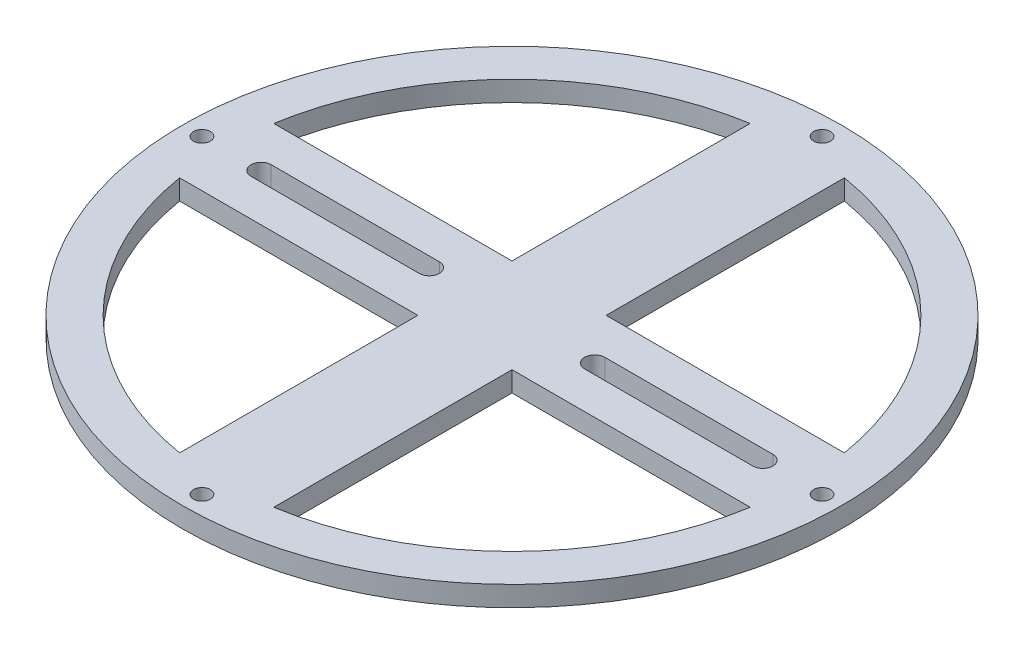
ISO-10303-21;
HEADER;
FILE_DESCRIPTION(('STEP AP214'),'2;1');
FILE_NAME('part.step','',(''),(''),'','','');
FILE_SCHEMA(('AUTOMOTIVE_DESIGN { 1 0 10303 214 1 1 1 1 }'));
ENDSEC;
DATA;
#1=APPLICATION_CONTEXT('core data for automotive mechanical design processes');
#2=APPLICATION_PROTOCOL_DEFINITION('international standard','automotive_design',2000,#1);
#3=PRODUCT_CONTEXT('',#1,'mechanical');
#4=PRODUCT('Part','Part','',(#3));
#5=PRODUCT_RELATED_PRODUCT_CATEGORY('part','',(#4));
#6=PRODUCT_DEFINITION_FORMATION('','',#4);
#7=PRODUCT_DEFINITION_CONTEXT('part definition',#1,'design');
#8=PRODUCT_DEFINITION('design','',#6,#7);
#9=PRODUCT_DEFINITION_SHAPE('','',#8);
#10=(LENGTH_UNIT() NAMED_UNIT(*) SI_UNIT(.MILLI.,.METRE.));
#11=(NAMED_UNIT(*) PLANE_ANGLE_UNIT() SI_UNIT($,.RADIAN.));
#12=(NAMED_UNIT(*) SI_UNIT($,.STERADIAN.) SOLID_ANGLE_UNIT());
#13=UNCERTAINTY_MEASURE_WITH_UNIT(LENGTH_MEASURE(1.E-05),#10,'distance_accuracy_value','');
#14=(GEOMETRIC_REPRESENTATION_CONTEXT(3) GLOBAL_UNCERTAINTY_ASSIGNED_CONTEXT((#13)) GLOBAL_UNIT_ASSIGNED_CONTEXT((#10,
#11,#12)) REPRESENTATION_CONTEXT('',''));
#15=CARTESIAN_POINT('',(0.,0.,0.));
#16=DIRECTION('',(0.,0.,1.));
#17=DIRECTION('',(1.,0.,0.));
#18=AXIS2_PLACEMENT_3D('',#15,#16,#17);
#19=CARTESIAN_POINT('',(0.,3.,0.));
#20=DIRECTION('',(0.,-1.,0.));
#21=DIRECTION('',(0.,0.,-1.));
#22=AXIS2_PLACEMENT_3D('',#19,#20,#21);
#23=CYLINDRICAL_SURFACE('',#22,49.);
#24=CARTESIAN_POINT('',(0.,3.,0.));
#25=DIRECTION('',(0.,1.,0.));
#26=DIRECTION('',(0.,0.,1.));
#27=AXIS2_PLACEMENT_3D('',#24,#25,#26);
#28=CIRCLE('',#27,49.);
#29=CARTESIAN_POINT('',(0.,3.,49.));
#30=VERTEX_POINT('',#29);
#31=EDGE_CURVE('E11',#30,#30,#28,.T.);
#32=ORIENTED_EDGE('',*,*,#31,.F.);
#33=EDGE_LOOP('',(#32));
#34=FACE_BOUND('',#33,.T.);
#35=CARTESIAN_POINT('',(0.,0.,0.));
#36=DIRECTION('',(0.,1.,0.));
#37=DIRECTION('',(0.,0.,1.));
#38=AXIS2_PLACEMENT_3D('',#35,#36,#37);
#39=CIRCLE('',#38,49.);
#40=CARTESIAN_POINT('',(0.,0.,49.));
#41=VERTEX_POINT('',#40);
#42=EDGE_CURVE('E37',#41,#41,#39,.T.);
#43=ORIENTED_EDGE('',*,*,#42,.T.);
#44=EDGE_LOOP('',(#43));
#45=FACE_BOUND('',#44,.T.);
#46=ADVANCED_FACE('F34',(#34,#45),#23,.T.);
#47=CARTESIAN_POINT('',(0.,3.,0.));
#48=DIRECTION('',(0.,1.,0.));
#49=DIRECTION('',(0.,0.,1.));
#50=AXIS2_PLACEMENT_3D('',#47,#48,#49);
#51=PLANE('',#50);
#52=CARTESIAN_POINT('',(0.,3.,0.));
#53=DIRECTION('',(0.,1.,0.));
#54=DIRECTION('',(-1.,0.,0.));
#55=AXIS2_PLACEMENT_3D('',#52,#53,#54);
#56=CIRCLE('',#55,42.9937144750809);
#57=CARTESIAN_POINT('',(-6.99999999999956,3.,-42.420036355062));
#58=VERTEX_POINT('',#57);
#59=CARTESIAN_POINT('',(-42.4200363550619,3.,-7.00000000000044));
#60=VERTEX_POINT('',#59);
#61=EDGE_CURVE('E48',#58,#60,#56,.T.);
#62=ORIENTED_EDGE('',*,*,#61,.F.);
#63=DIRECTION('',(0.,0.,-1.));
#64=VECTOR('',#63,1.);
#65=CARTESIAN_POINT('',(-6.99999999999993,3.,-7.00000000000008));
#66=LINE('',#65,#64);
#67=CARTESIAN_POINT('',(-6.99999999999993,3.,-7.00000000000008));
#68=VERTEX_POINT('',#67);
#69=EDGE_CURVE('E185',#68,#58,#66,.T.);
#70=ORIENTED_EDGE('',*,*,#69,.F.);
#71=DIRECTION('',(1.,0.,0.));
#72=VECTOR('',#71,1.);
#73=CARTESIAN_POINT('',(-42.4200363550619,3.,-7.00000000000044));
#74=LINE('',#73,#72);
#75=EDGE_CURVE('E188',#60,#68,#74,.T.);
#76=ORIENTED_EDGE('',*,*,#75,.F.);
#77=EDGE_LOOP('',(#62,#70,#76));
#78=FACE_BOUND('',#77,.T.);
#79=CARTESIAN_POINT('',(0.,3.,0.));
#80=DIRECTION('',(0.,1.,0.));
#81=DIRECTION('',(0.,0.,1.));
#82=AXIS2_PLACEMENT_3D('',#79,#80,#81);
#83=CIRCLE('',#82,42.9937144750809);
#84=CARTESIAN_POINT('',(-42.4200363550619,3.,7.));
#85=VERTEX_POINT('',#84);
#86=CARTESIAN_POINT('',(-7.,3.,42.4200363550619));
#87=VERTEX_POINT('',#86);
#88=EDGE_CURVE('E196',#85,#87,#83,.T.);
#89=ORIENTED_EDGE('',*,*,#88,.F.);
#90=DIRECTION('',(-1.,0.,0.));
#91=VECTOR('',#90,1.);
#92=CARTESIAN_POINT('',(-7.,3.,7.));
#93=LINE('',#92,#91);
#94=CARTESIAN_POINT('',(-7.,3.,7.));
#95=VERTEX_POINT('',#94);
#96=EDGE_CURVE('E202',#95,#85,#93,.T.);
#97=ORIENTED_EDGE('',*,*,#96,.F.);
#98=DIRECTION('',(0.,0.,-1.));
#99=VECTOR('',#98,1.);
#100=CARTESIAN_POINT('',(-7.,3.,42.4200363550619));
#101=LINE('',#100,#99);
#102=EDGE_CURVE('E210',#87,#95,#101,.T.);
#103=ORIENTED_EDGE('',*,*,#102,.F.);
#104=EDGE_LOOP('',(#89,#97,#103));
#105=FACE_BOUND('',#104,.T.);
#106=CARTESIAN_POINT('',(0.,3.,0.));
#107=DIRECTION('',(0.,1.,0.));
#108=DIRECTION('',(1.,0.,0.));
#109=AXIS2_PLACEMENT_3D('',#106,#107,#108);
#110=CIRCLE('',#109,42.9937144750809);
#111=CARTESIAN_POINT('',(6.99999999999985,3.,42.420036355062));
#112=VERTEX_POINT('',#111);
#113=CARTESIAN_POINT('',(42.4200363550619,3.,7.00000000000015));
#114=VERTEX_POINT('',#113);
#115=EDGE_CURVE('E217',#112,#114,#110,.T.);
#116=ORIENTED_EDGE('',*,*,#115,.F.);
#117=DIRECTION('',(0.,0.,1.));
#118=VECTOR('',#117,1.);
#119=CARTESIAN_POINT('',(6.99999999999998,3.,7.00000000000003));
#120=LINE('',#119,#118);
#121=CARTESIAN_POINT('',(6.99999999999998,3.,7.00000000000003));
#122=VERTEX_POINT('',#121);
#123=EDGE_CURVE('E226',#122,#112,#120,.T.);
#124=ORIENTED_EDGE('',*,*,#123,.F.);
#125=DIRECTION('',(-1.,0.,0.));
#126=VECTOR('',#125,1.);
#127=CARTESIAN_POINT('',(42.4200363550619,3.,7.00000000000015));
#128=LINE('',#127,#126);
#129=EDGE_CURVE('E234',#114,#122,#128,.T.);
#130=ORIENTED_EDGE('',*,*,#129,.F.);
#131=EDGE_LOOP('',(#116,#124,#130));
#132=FACE_BOUND('',#131,.T.);
#133=CARTESIAN_POINT('',(-46.1,3.,-4.82871869162005E-13));
#134=DIRECTION('',(0.,1.,0.));
#135=DIRECTION('',(1.,0.,0.));
#136=AXIS2_PLACEMENT_3D('',#133,#134,#135);
#137=CIRCLE('',#136,1.25);
#138=CARTESIAN_POINT('',(-44.85,3.,-4.69778814141344E-13));
#139=VERTEX_POINT('',#138);
#140=EDGE_CURVE('E241',#139,#139,#137,.T.);
#141=ORIENTED_EDGE('',*,*,#140,.F.);
#142=EDGE_LOOP('',(#141));
#143=FACE_BOUND('',#142,.T.);
#144=CARTESIAN_POINT('',(0.,3.,46.1));
#145=DIRECTION('',(0.,1.,0.));
#146=DIRECTION('',(0.,0.,-1.));
#147=AXIS2_PLACEMENT_3D('',#144,#145,#146);
#148=CIRCLE('',#147,1.25);
#149=CARTESIAN_POINT('',(0.,3.,44.85));
#150=VERTEX_POINT('',#149);
#151=EDGE_CURVE('E249',#150,#150,#148,.T.);
#152=ORIENTED_EDGE('',*,*,#151,.F.);
#153=EDGE_LOOP('',(#152));
#154=FACE_BOUND('',#153,.T.);
#155=CARTESIAN_POINT('',(46.1,3.,1.60957289720668E-13));
#156=DIRECTION('',(0.,1.,0.));
#157=DIRECTION('',(-1.,0.,0.));
#158=AXIS2_PLACEMENT_3D('',#155,#156,#157);
#159=CIRCLE('',#158,1.25);
#160=CARTESIAN_POINT('',(44.85,3.,1.56592938047115E-13));
#161=VERTEX_POINT('',#160);
#162=EDGE_CURVE('E255',#161,#161,#159,.T.);
#163=ORIENTED_EDGE('',*,*,#162,.F.);
#164=EDGE_LOOP('',(#163));
#165=FACE_BOUND('',#164,.T.);
#166=CARTESIAN_POINT('',(0.,3.,-46.1));
#167=DIRECTION('',(0.,1.,0.));
#168=DIRECTION('',(0.,0.,1.));
#169=AXIS2_PLACEMENT_3D('',#166,#167,#168);
#170=CIRCLE('',#169,1.25);
#171=CARTESIAN_POINT('',(0.,3.,-44.85));
#172=VERTEX_POINT('',#171);
#173=EDGE_CURVE('E261',#172,#172,#170,.T.);
#174=ORIENTED_EDGE('',*,*,#173,.F.);
#175=EDGE_LOOP('',(#174));
#176=FACE_BOUND('',#175,.T.);
#177=CARTESIAN_POINT('',(12.3,3.,0.));
#178=DIRECTION('',(0.,1.,0.));
#179=DIRECTION('',(0.,0.,-1.));
#180=AXIS2_PLACEMENT_3D('',#177,#178,#179);
#181=CIRCLE('',#180,1.5);
#182=CARTESIAN_POINT('',(12.3,3.,-1.5));
#183=VERTEX_POINT('',#182);
#184=CARTESIAN_POINT('',(12.3,3.,1.5));
#185=VERTEX_POINT('',#184);
#186=EDGE_CURVE('E267',#183,#185,#181,.T.);
#187=ORIENTED_EDGE('',*,*,#186,.F.);
#188=DIRECTION('',(-1.,0.,0.));
#189=VECTOR('',#188,1.);
#190=CARTESIAN_POINT('',(12.3,3.,-1.5));
#191=LINE('',#190,#189);
#192=CARTESIAN_POINT('',(37.3,3.,-1.5));
#193=VERTEX_POINT('',#192);
#194=EDGE_CURVE('E274',#193,#183,#191,.T.);
#195=ORIENTED_EDGE('',*,*,#194,.F.);
#196=CARTESIAN_POINT('',(37.3,3.,0.));
#197=DIRECTION('',(0.,1.,0.));
#198=DIRECTION('',(0.,0.,-1.));
#199=AXIS2_PLACEMENT_3D('',#196,#197,#198);
#200=CIRCLE('',#199,1.5);
#201=CARTESIAN_POINT('',(37.3,3.,1.5));
#202=VERTEX_POINT('',#201);
#203=EDGE_CURVE('E288',#202,#193,#200,.T.);
#204=ORIENTED_EDGE('',*,*,#203,.F.);
#205=DIRECTION('',(1.,0.,0.));
#206=VECTOR('',#205,1.);
#207=CARTESIAN_POINT('',(12.3,3.,1.5));
#208=LINE('',#207,#206);
#209=EDGE_CURVE('E285',#185,#202,#208,.T.);
#210=ORIENTED_EDGE('',*,*,#209,.F.);
#211=EDGE_LOOP('',(#187,#195,#204,#210));
#212=FACE_BOUND('',#211,.T.);
#213=CARTESIAN_POINT('',(-12.3,3.,0.));
#214=DIRECTION('',(0.,1.,0.));
#215=DIRECTION('',(0.,0.,1.));
#216=AXIS2_PLACEMENT_3D('',#213,#214,#215);
#217=CIRCLE('',#216,1.5);
#218=CARTESIAN_POINT('',(-12.3,3.,1.5));
#219=VERTEX_POINT('',#218);
#220=CARTESIAN_POINT('',(-12.3,3.,-1.5));
#221=VERTEX_POINT('',#220);
#222=EDGE_CURVE('E295',#219,#221,#217,.T.);
#223=ORIENTED_EDGE('',*,*,#222,.F.);
#224=DIRECTION('',(1.,0.,0.));
#225=VECTOR('',#224,1.);
#226=CARTESIAN_POINT('',(-12.3,3.,1.5));
#227=LINE('',#226,#225);
#228=CARTESIAN_POINT('',(-37.3,3.,1.5));
#229=VERTEX_POINT('',#228);
#230=EDGE_CURVE('E306',#229,#219,#227,.T.);
#231=ORIENTED_EDGE('',*,*,#230,.F.);
#232=CARTESIAN_POINT('',(-37.3,3.,0.));
#233=DIRECTION('',(0.,1.,0.));
#234=DIRECTION('',(0.,0.,1.));
#235=AXIS2_PLACEMENT_3D('',#232,#233,#234);
#236=CIRCLE('',#235,1.5);
#237=CARTESIAN_POINT('',(-37.3,3.,-1.5));
#238=VERTEX_POINT('',#237);
#239=EDGE_CURVE('E320',#238,#229,#236,.T.);
#240=ORIENTED_EDGE('',*,*,#239,.F.);
#241=DIRECTION('',(-1.,0.,0.));
#242=VECTOR('',#241,1.);
#243=CARTESIAN_POINT('',(-12.3,3.,-1.5));
#244=LINE('',#243,#242);
#245=EDGE_CURVE('E317',#221,#238,#244,.T.);
#246=ORIENTED_EDGE('',*,*,#245,.F.);
#247=EDGE_LOOP('',(#223,#231,#240,#246));
#248=FACE_BOUND('',#247,.T.);
#249=CARTESIAN_POINT('',(0.,3.,0.));
#250=DIRECTION('',(0.,1.,0.));
#251=DIRECTION('',(0.,0.,-1.));
#252=AXIS2_PLACEMENT_3D('',#249,#250,#251);
#253=CIRCLE('',#252,42.9937144750809);
#254=CARTESIAN_POINT('',(42.4200363550619,3.,-7.));
#255=VERTEX_POINT('',#254);
#256=CARTESIAN_POINT('',(7.,3.,-42.4200363550619));
#257=VERTEX_POINT('',#256);
#258=EDGE_CURVE('E327',#255,#257,#253,.T.);
#259=ORIENTED_EDGE('',*,*,#258,.F.);
#260=DIRECTION('',(1.,0.,0.));
#261=VECTOR('',#260,1.);
#262=CARTESIAN_POINT('',(7.,3.,-7.));
#263=LINE('',#262,#261);
#264=CARTESIAN_POINT('',(7.,3.,-7.));
#265=VERTEX_POINT('',#264);
#266=EDGE_CURVE('E338',#265,#255,#263,.T.);
#267=ORIENTED_EDGE('',*,*,#266,.F.);
#268=DIRECTION('',(0.,0.,1.));
#269=VECTOR('',#268,1.);
#270=CARTESIAN_POINT('',(7.,3.,-42.4200363550619));
#271=LINE('',#270,#269);
#272=EDGE_CURVE('E346',#257,#265,#271,.T.);
#273=ORIENTED_EDGE('',*,*,#272,.F.);
#274=EDGE_LOOP('',(#259,#267,#273));
#275=FACE_BOUND('',#274,.T.);
#276=ORIENTED_EDGE('',*,*,#31,.T.);
#277=EDGE_LOOP('',(#276));
#278=FACE_BOUND('',#277,.T.);
#279=ADVANCED_FACE('F366',(#78,#105,#132,#143,#154,#165,#176,#212,#248,#275,#278),#51,.T.);
#280=CARTESIAN_POINT('',(0.,0.,0.));
#281=DIRECTION('',(0.,1.,0.));
#282=DIRECTION('',(0.,0.,1.));
#283=AXIS2_PLACEMENT_3D('',#280,#281,#282);
#284=PLANE('',#283);
#285=DIRECTION('',(0.,0.,-1.));
#286=VECTOR('',#285,1.);
#287=CARTESIAN_POINT('',(-6.99999999999993,0.,-7.00000000000008));
#288=LINE('',#287,#286);
#289=CARTESIAN_POINT('',(-6.99999999999993,0.,-7.00000000000008));
#290=VERTEX_POINT('',#289);
#291=CARTESIAN_POINT('',(-6.99999999999956,0.,-42.420036355062));
#292=VERTEX_POINT('',#291);
#293=EDGE_CURVE('E56',#290,#292,#288,.T.);
#294=ORIENTED_EDGE('',*,*,#293,.T.);
#295=CARTESIAN_POINT('',(0.,0.,0.));
#296=DIRECTION('',(0.,1.,0.));
#297=DIRECTION('',(-1.,0.,0.));
#298=AXIS2_PLACEMENT_3D('',#295,#296,#297);
#299=CIRCLE('',#298,42.9937144750809);
#300=CARTESIAN_POINT('',(-42.4200363550619,0.,-7.00000000000044));
#301=VERTEX_POINT('',#300);
#302=EDGE_CURVE('E172',#292,#301,#299,.T.);
#303=ORIENTED_EDGE('',*,*,#302,.T.);
#304=DIRECTION('',(1.,0.,0.));
#305=VECTOR('',#304,1.);
#306=CARTESIAN_POINT('',(-42.4200363550619,0.,-7.00000000000044));
#307=LINE('',#306,#305);
#308=EDGE_CURVE('E179',#301,#290,#307,.T.);
#309=ORIENTED_EDGE('',*,*,#308,.T.);
#310=EDGE_LOOP('',(#294,#303,#309));
#311=FACE_BOUND('',#310,.T.);
#312=DIRECTION('',(-1.,0.,0.));
#313=VECTOR('',#312,1.);
#314=CARTESIAN_POINT('',(-7.,0.,7.));
#315=LINE('',#314,#313);
#316=CARTESIAN_POINT('',(-7.,0.,7.));
#317=VERTEX_POINT('',#316);
#318=CARTESIAN_POINT('',(-42.4200363550619,0.,7.));
#319=VERTEX_POINT('',#318);
#320=EDGE_CURVE('E205',#317,#319,#315,.T.);
#321=ORIENTED_EDGE('',*,*,#320,.T.);
#322=CARTESIAN_POINT('',(0.,0.,0.));
#323=DIRECTION('',(0.,1.,0.));
#324=DIRECTION('',(0.,0.,1.));
#325=AXIS2_PLACEMENT_3D('',#322,#323,#324);
#326=CIRCLE('',#325,42.9937144750809);
#327=CARTESIAN_POINT('',(-7.,0.,42.4200363550619));
#328=VERTEX_POINT('',#327);
#329=EDGE_CURVE('E198',#319,#328,#326,.T.);
#330=ORIENTED_EDGE('',*,*,#329,.T.);
#331=DIRECTION('',(0.,0.,-1.));
#332=VECTOR('',#331,1.);
#333=CARTESIAN_POINT('',(-7.,0.,42.4200363550619));
#334=LINE('',#333,#332);
#335=EDGE_CURVE('E201',#328,#317,#334,.T.);
#336=ORIENTED_EDGE('',*,*,#335,.T.);
#337=EDGE_LOOP('',(#321,#330,#336));
#338=FACE_BOUND('',#337,.T.);
#339=DIRECTION('',(0.,0.,1.));
#340=VECTOR('',#339,1.);
#341=CARTESIAN_POINT('',(6.99999999999998,0.,7.00000000000003));
#342=LINE('',#341,#340);
#343=CARTESIAN_POINT('',(6.99999999999998,0.,7.00000000000003));
#344=VERTEX_POINT('',#343);
#345=CARTESIAN_POINT('',(6.99999999999985,0.,42.420036355062));
#346=VERTEX_POINT('',#345);
#347=EDGE_CURVE('E229',#344,#346,#342,.T.);
#348=ORIENTED_EDGE('',*,*,#347,.T.);
#349=CARTESIAN_POINT('',(0.,0.,0.));
#350=DIRECTION('',(0.,1.,0.));
#351=DIRECTION('',(1.,0.,0.));
#352=AXIS2_PLACEMENT_3D('',#349,#350,#351);
#353=CIRCLE('',#352,42.9937144750809);
#354=CARTESIAN_POINT('',(42.4200363550619,0.,7.00000000000015));
#355=VERTEX_POINT('',#354);
#356=EDGE_CURVE('E222',#346,#355,#353,.T.);
#357=ORIENTED_EDGE('',*,*,#356,.T.);
#358=DIRECTION('',(-1.,0.,0.));
#359=VECTOR('',#358,1.);
#360=CARTESIAN_POINT('',(42.4200363550619,0.,7.00000000000015));
#361=LINE('',#360,#359);
#362=EDGE_CURVE('E225',#355,#344,#361,.T.);
#363=ORIENTED_EDGE('',*,*,#362,.T.);
#364=EDGE_LOOP('',(#348,#357,#363));
#365=FACE_BOUND('',#364,.T.);
#366=CARTESIAN_POINT('',(-46.1,0.,-4.82871869162005E-13));
#367=DIRECTION('',(0.,1.,0.));
#368=DIRECTION('',(1.,0.,0.));
#369=AXIS2_PLACEMENT_3D('',#366,#367,#368);
#370=CIRCLE('',#369,1.25);
#371=CARTESIAN_POINT('',(-44.85,0.,-4.69778814141344E-13));
#372=VERTEX_POINT('',#371);
#373=EDGE_CURVE('E246',#372,#372,#370,.T.);
#374=ORIENTED_EDGE('',*,*,#373,.T.);
#375=EDGE_LOOP('',(#374));
#376=FACE_BOUND('',#375,.T.);
#377=CARTESIAN_POINT('',(0.,0.,46.1));
#378=DIRECTION('',(0.,1.,0.));
#379=DIRECTION('',(0.,0.,-1.));
#380=AXIS2_PLACEMENT_3D('',#377,#378,#379);
#381=CIRCLE('',#380,1.25);
#382=CARTESIAN_POINT('',(0.,0.,44.85));
#383=VERTEX_POINT('',#382);
#384=EDGE_CURVE('E252',#383,#383,#381,.T.);
#385=ORIENTED_EDGE('',*,*,#384,.T.);
#386=EDGE_LOOP('',(#385));
#387=FACE_BOUND('',#386,.T.);
#388=CARTESIAN_POINT('',(46.1,0.,1.60957289720668E-13));
#389=DIRECTION('',(0.,1.,0.));
#390=DIRECTION('',(-1.,0.,0.));
#391=AXIS2_PLACEMENT_3D('',#388,#389,#390);
#392=CIRCLE('',#391,1.25);
#393=CARTESIAN_POINT('',(44.85,0.,1.56592938047115E-13));
#394=VERTEX_POINT('',#393);
#395=EDGE_CURVE('E258',#394,#394,#392,.T.);
#396=ORIENTED_EDGE('',*,*,#395,.T.);
#397=EDGE_LOOP('',(#396));
#398=FACE_BOUND('',#397,.T.);
#399=CARTESIAN_POINT('',(0.,0.,-46.1));
#400=DIRECTION('',(0.,1.,0.));
#401=DIRECTION('',(0.,0.,1.));
#402=AXIS2_PLACEMENT_3D('',#399,#400,#401);
#403=CIRCLE('',#402,1.25);
#404=CARTESIAN_POINT('',(0.,0.,-44.85));
#405=VERTEX_POINT('',#404);
#406=EDGE_CURVE('E264',#405,#405,#403,.T.);
#407=ORIENTED_EDGE('',*,*,#406,.T.);
#408=EDGE_LOOP('',(#407));
#409=FACE_BOUND('',#408,.T.);
#410=DIRECTION('',(-1.,0.,0.));
#411=VECTOR('',#410,1.);
#412=CARTESIAN_POINT('',(12.3,0.,-1.5));
#413=LINE('',#412,#411);
#414=CARTESIAN_POINT('',(37.3,0.,-1.5));
#415=VERTEX_POINT('',#414);
#416=CARTESIAN_POINT('',(12.3,0.,-1.5));
#417=VERTEX_POINT('',#416);
#418=EDGE_CURVE('E280',#415,#417,#413,.T.);
#419=ORIENTED_EDGE('',*,*,#418,.T.);
#420=CARTESIAN_POINT('',(12.3,0.,0.));
#421=DIRECTION('',(0.,1.,0.));
#422=DIRECTION('',(0.,0.,-1.));
#423=AXIS2_PLACEMENT_3D('',#420,#421,#422);
#424=CIRCLE('',#423,1.5);
#425=CARTESIAN_POINT('',(12.3,0.,1.5));
#426=VERTEX_POINT('',#425);
#427=EDGE_CURVE('E270',#417,#426,#424,.T.);
#428=ORIENTED_EDGE('',*,*,#427,.T.);
#429=DIRECTION('',(1.,0.,0.));
#430=VECTOR('',#429,1.);
#431=CARTESIAN_POINT('',(12.3,0.,1.5));
#432=LINE('',#431,#430);
#433=CARTESIAN_POINT('',(37.3,0.,1.5));
#434=VERTEX_POINT('',#433);
#435=EDGE_CURVE('E273',#426,#434,#432,.T.);
#436=ORIENTED_EDGE('',*,*,#435,.T.);
#437=CARTESIAN_POINT('',(37.3,0.,0.));
#438=DIRECTION('',(0.,1.,0.));
#439=DIRECTION('',(0.,0.,-1.));
#440=AXIS2_PLACEMENT_3D('',#437,#438,#439);
#441=CIRCLE('',#440,1.5);
#442=EDGE_CURVE('E277',#434,#415,#441,.T.);
#443=ORIENTED_EDGE('',*,*,#442,.T.);
#444=EDGE_LOOP('',(#419,#428,#436,#443));
#445=FACE_BOUND('',#444,.T.);
#446=DIRECTION('',(1.,0.,0.));
#447=VECTOR('',#446,1.);
#448=CARTESIAN_POINT('',(-12.3,0.,1.5));
#449=LINE('',#448,#447);
#450=CARTESIAN_POINT('',(-37.3,0.,1.5));
#451=VERTEX_POINT('',#450);
#452=CARTESIAN_POINT('',(-12.3,0.,1.5));
#453=VERTEX_POINT('',#452);
#454=EDGE_CURVE('E312',#451,#453,#449,.T.);
#455=ORIENTED_EDGE('',*,*,#454,.T.);
#456=CARTESIAN_POINT('',(-12.3,0.,0.));
#457=DIRECTION('',(0.,1.,0.));
#458=DIRECTION('',(0.,0.,1.));
#459=AXIS2_PLACEMENT_3D('',#456,#457,#458);
#460=CIRCLE('',#459,1.5);
#461=CARTESIAN_POINT('',(-12.3,0.,-1.5));
#462=VERTEX_POINT('',#461);
#463=EDGE_CURVE('E302',#453,#462,#460,.T.);
#464=ORIENTED_EDGE('',*,*,#463,.T.);
#465=DIRECTION('',(-1.,0.,0.));
#466=VECTOR('',#465,1.);
#467=CARTESIAN_POINT('',(-12.3,0.,-1.5));
#468=LINE('',#467,#466);
#469=CARTESIAN_POINT('',(-37.3,0.,-1.5));
#470=VERTEX_POINT('',#469);
#471=EDGE_CURVE('E305',#462,#470,#468,.T.);
#472=ORIENTED_EDGE('',*,*,#471,.T.);
#473=CARTESIAN_POINT('',(-37.3,0.,0.));
#474=DIRECTION('',(0.,1.,0.));
#475=DIRECTION('',(0.,0.,1.));
#476=AXIS2_PLACEMENT_3D('',#473,#474,#475);
#477=CIRCLE('',#476,1.5);
#478=EDGE_CURVE('E309',#470,#451,#477,.T.);
#479=ORIENTED_EDGE('',*,*,#478,.T.);
#480=EDGE_LOOP('',(#455,#464,#472,#479));
#481=FACE_BOUND('',#480,.T.);
#482=DIRECTION('',(1.,0.,0.));
#483=VECTOR('',#482,1.);
#484=CARTESIAN_POINT('',(7.,0.,-7.));
#485=LINE('',#484,#483);
#486=CARTESIAN_POINT('',(7.,0.,-7.));
#487=VERTEX_POINT('',#486);
#488=CARTESIAN_POINT('',(42.4200363550619,0.,-7.));
#489=VERTEX_POINT('',#488);
#490=EDGE_CURVE('E341',#487,#489,#485,.T.);
#491=ORIENTED_EDGE('',*,*,#490,.T.);
#492=CARTESIAN_POINT('',(0.,0.,0.));
#493=DIRECTION('',(0.,1.,0.));
#494=DIRECTION('',(0.,0.,-1.));
#495=AXIS2_PLACEMENT_3D('',#492,#493,#494);
#496=CIRCLE('',#495,42.9937144750809);
#497=CARTESIAN_POINT('',(7.,0.,-42.4200363550619));
#498=VERTEX_POINT('',#497);
#499=EDGE_CURVE('E334',#489,#498,#496,.T.);
#500=ORIENTED_EDGE('',*,*,#499,.T.);
#501=DIRECTION('',(0.,0.,1.));
#502=VECTOR('',#501,1.);
#503=CARTESIAN_POINT('',(7.,0.,-42.4200363550619));
#504=LINE('',#503,#502);
#505=EDGE_CURVE('E337',#498,#487,#504,.T.);
#506=ORIENTED_EDGE('',*,*,#505,.T.);
#507=EDGE_LOOP('',(#491,#500,#506));
#508=FACE_BOUND('',#507,.T.);
#509=ORIENTED_EDGE('',*,*,#42,.F.);
#510=EDGE_LOOP('',(#509));
#511=FACE_BOUND('',#510,.T.);
#512=ADVANCED_FACE('F183',(#311,#338,#365,#376,#387,#398,#409,#445,#481,#508,#511),#284,.F.);
#513=CARTESIAN_POINT('',(0.,0.,0.));
#514=DIRECTION('',(0.,1.,0.));
#515=DIRECTION('',(0.,0.,1.));
#516=AXIS2_PLACEMENT_3D('',#513,#514,#515);
#517=CYLINDRICAL_SURFACE('',#516,42.9937144750809);
#518=ORIENTED_EDGE('',*,*,#258,.T.);
#519=DIRECTION('',(0.,1.,0.));
#520=VECTOR('',#519,1.);
#521=CARTESIAN_POINT('',(7.,0.,-42.4200363550619));
#522=LINE('',#521,#520);
#523=EDGE_CURVE('E344',#498,#257,#522,.T.);
#524=ORIENTED_EDGE('',*,*,#523,.F.);
#525=ORIENTED_EDGE('',*,*,#499,.F.);
#526=DIRECTION('',(0.,1.,0.));
#527=VECTOR('',#526,1.);
#528=CARTESIAN_POINT('',(42.4200363550619,0.,-7.));
#529=LINE('',#528,#527);
#530=EDGE_CURVE('E351',#489,#255,#529,.T.);
#531=ORIENTED_EDGE('',*,*,#530,.T.);
#532=EDGE_LOOP('',(#518,#524,#525,#531));
#533=FACE_BOUND('',#532,.T.);
#534=ADVANCED_FACE('F372',(#533),#517,.F.);
#535=CARTESIAN_POINT('',(7.,0.,-7.));
#536=DIRECTION('',(0.,0.,1.));
#537=DIRECTION('',(1.,0.,0.));
#538=AXIS2_PLACEMENT_3D('',#535,#536,#537);
#539=PLANE('',#538);
#540=ORIENTED_EDGE('',*,*,#266,.T.);
#541=ORIENTED_EDGE('',*,*,#530,.F.);
#542=ORIENTED_EDGE('',*,*,#490,.F.);
#543=DIRECTION('',(0.,1.,0.));
#544=VECTOR('',#543,1.);
#545=CARTESIAN_POINT('',(7.,0.,-7.));
#546=LINE('',#545,#544);
#547=EDGE_CURVE('E353',#487,#265,#546,.T.);
#548=ORIENTED_EDGE('',*,*,#547,.T.);
#549=EDGE_LOOP('',(#540,#541,#542,#548));
#550=FACE_BOUND('',#549,.T.);
#551=ADVANCED_FACE('F369',(#550),#539,.F.);
#552=CARTESIAN_POINT('',(7.,0.,-42.4200363550619));
#553=DIRECTION('',(-1.,0.,0.));
#554=DIRECTION('',(0.,0.,1.));
#555=AXIS2_PLACEMENT_3D('',#552,#553,#554);
#556=PLANE('',#555);
#557=ORIENTED_EDGE('',*,*,#272,.T.);
#558=ORIENTED_EDGE('',*,*,#547,.F.);
#559=ORIENTED_EDGE('',*,*,#505,.F.);
#560=ORIENTED_EDGE('',*,*,#523,.T.);
#561=EDGE_LOOP('',(#557,#558,#559,#560));
#562=FACE_BOUND('',#561,.T.);
#563=ADVANCED_FACE('F359',(#562),#556,.F.);
#564=CARTESIAN_POINT('',(-12.3,0.,0.));
#565=DIRECTION('',(0.,1.,0.));
#566=DIRECTION('',(0.,0.,1.));
#567=AXIS2_PLACEMENT_3D('',#564,#565,#566);
#568=CYLINDRICAL_SURFACE('',#567,1.5);
#569=ORIENTED_EDGE('',*,*,#222,.T.);
#570=DIRECTION('',(0.,1.,0.));
#571=VECTOR('',#570,1.);
#572=CARTESIAN_POINT('',(-12.3,0.,-1.5));
#573=LINE('',#572,#571);
#574=EDGE_CURVE('E315',#462,#221,#573,.T.);
#575=ORIENTED_EDGE('',*,*,#574,.F.);
#576=ORIENTED_EDGE('',*,*,#463,.F.);
#577=DIRECTION('',(0.,1.,0.));
#578=VECTOR('',#577,1.);
#579=CARTESIAN_POINT('',(-12.3,0.,1.5));
#580=LINE('',#579,#578);
#581=EDGE_CURVE('E325',#453,#219,#580,.T.);
#582=ORIENTED_EDGE('',*,*,#581,.T.);
#583=EDGE_LOOP('',(#569,#575,#576,#582));
#584=FACE_BOUND('',#583,.T.);
#585=ADVANCED_FACE('F421',(#584),#568,.F.);
#586=CARTESIAN_POINT('',(-12.3,0.,1.5));
#587=DIRECTION('',(0.,0.,1.));
#588=DIRECTION('',(1.,0.,0.));
#589=AXIS2_PLACEMENT_3D('',#586,#587,#588);
#590=PLANE('',#589);
#591=ORIENTED_EDGE('',*,*,#230,.T.);
#592=ORIENTED_EDGE('',*,*,#581,.F.);
#593=ORIENTED_EDGE('',*,*,#454,.F.);
#594=DIRECTION('',(0.,1.,0.));
#595=VECTOR('',#594,1.);
#596=CARTESIAN_POINT('',(-37.3,0.,1.5));
#597=LINE('',#596,#595);
#598=EDGE_CURVE('E328',#451,#229,#597,.T.);
#599=ORIENTED_EDGE('',*,*,#598,.T.);
#600=EDGE_LOOP('',(#591,#592,#593,#599));
#601=FACE_BOUND('',#600,.T.);
#602=ADVANCED_FACE('F430',(#601),#590,.F.);
#603=CARTESIAN_POINT('',(-37.3,0.,0.));
#604=DIRECTION('',(0.,1.,0.));
#605=DIRECTION('',(0.,0.,1.));
#606=AXIS2_PLACEMENT_3D('',#603,#604,#605);
#607=CYLINDRICAL_SURFACE('',#606,1.5);
#608=ORIENTED_EDGE('',*,*,#239,.T.);
#609=ORIENTED_EDGE('',*,*,#598,.F.);
#610=ORIENTED_EDGE('',*,*,#478,.F.);
#611=DIRECTION('',(0.,1.,0.));
#612=VECTOR('',#611,1.);
#613=CARTESIAN_POINT('',(-37.3,0.,-1.5));
#614=LINE('',#613,#612);
#615=EDGE_CURVE('E330',#470,#238,#614,.T.);
#616=ORIENTED_EDGE('',*,*,#615,.T.);
#617=EDGE_LOOP('',(#608,#609,#610,#616));
#618=FACE_BOUND('',#617,.T.);
#619=ADVANCED_FACE('F432',(#618),#607,.F.);
#620=CARTESIAN_POINT('',(-12.3,0.,-1.5));
#621=DIRECTION('',(0.,0.,-1.));
#622=DIRECTION('',(-1.,0.,0.));
#623=AXIS2_PLACEMENT_3D('',#620,#621,#622);
#624=PLANE('',#623);
#625=ORIENTED_EDGE('',*,*,#245,.T.);
#626=ORIENTED_EDGE('',*,*,#615,.F.);
#627=ORIENTED_EDGE('',*,*,#471,.F.);
#628=ORIENTED_EDGE('',*,*,#574,.T.);
#629=EDGE_LOOP('',(#625,#626,#627,#628));
#630=FACE_BOUND('',#629,.T.);
#631=ADVANCED_FACE('F425',(#630),#624,.F.);
#632=CARTESIAN_POINT('',(12.3,0.,0.));
#633=DIRECTION('',(0.,1.,0.));
#634=DIRECTION('',(0.,0.,1.));
#635=AXIS2_PLACEMENT_3D('',#632,#633,#634);
#636=CYLINDRICAL_SURFACE('',#635,1.5);
#637=ORIENTED_EDGE('',*,*,#186,.T.);
#638=DIRECTION('',(0.,1.,0.));
#639=VECTOR('',#638,1.);
#640=CARTESIAN_POINT('',(12.3,0.,1.5));
#641=LINE('',#640,#639);
#642=EDGE_CURVE('E283',#426,#185,#641,.T.);
#643=ORIENTED_EDGE('',*,*,#642,.F.);
#644=ORIENTED_EDGE('',*,*,#427,.F.);
#645=DIRECTION('',(0.,1.,0.));
#646=VECTOR('',#645,1.);
#647=CARTESIAN_POINT('',(12.3,0.,-1.5));
#648=LINE('',#647,#646);
#649=EDGE_CURVE('E293',#417,#183,#648,.T.);
#650=ORIENTED_EDGE('',*,*,#649,.T.);
#651=EDGE_LOOP('',(#637,#643,#644,#650));
#652=FACE_BOUND('',#651,.T.);
#653=ADVANCED_FACE('F439',(#652),#636,.F.);
#654=CARTESIAN_POINT('',(12.3,0.,-1.5));
#655=DIRECTION('',(0.,0.,-1.));
#656=DIRECTION('',(-1.,0.,0.));
#657=AXIS2_PLACEMENT_3D('',#654,#655,#656);
#658=PLANE('',#657);
#659=ORIENTED_EDGE('',*,*,#194,.T.);
#660=ORIENTED_EDGE('',*,*,#649,.F.);
#661=ORIENTED_EDGE('',*,*,#418,.F.);
#662=DIRECTION('',(0.,1.,0.));
#663=VECTOR('',#662,1.);
#664=CARTESIAN_POINT('',(37.3,0.,-1.5));
#665=LINE('',#664,#663);
#666=EDGE_CURVE('E296',#415,#193,#665,.T.);
#667=ORIENTED_EDGE('',*,*,#666,.T.);
#668=EDGE_LOOP('',(#659,#660,#661,#667));
#669=FACE_BOUND('',#668,.T.);
#670=ADVANCED_FACE('F477',(#669),#658,.F.);
#671=CARTESIAN_POINT('',(37.3,0.,0.));
#672=DIRECTION('',(0.,1.,0.));
#673=DIRECTION('',(0.,0.,1.));
#674=AXIS2_PLACEMENT_3D('',#671,#672,#673);
#675=CYLINDRICAL_SURFACE('',#674,1.5);
#676=ORIENTED_EDGE('',*,*,#203,.T.);
#677=ORIENTED_EDGE('',*,*,#666,.F.);
#678=ORIENTED_EDGE('',*,*,#442,.F.);
#679=DIRECTION('',(0.,1.,0.));
#680=VECTOR('',#679,1.);
#681=CARTESIAN_POINT('',(37.3,0.,1.5));
#682=LINE('',#681,#680);
#683=EDGE_CURVE('E298',#434,#202,#682,.T.);
#684=ORIENTED_EDGE('',*,*,#683,.T.);
#685=EDGE_LOOP('',(#676,#677,#678,#684));
#686=FACE_BOUND('',#685,.T.);
#687=ADVANCED_FACE('F486',(#686),#675,.F.);
#688=CARTESIAN_POINT('',(12.3,0.,1.5));
#689=DIRECTION('',(0.,0.,1.));
#690=DIRECTION('',(1.,0.,0.));
#691=AXIS2_PLACEMENT_3D('',#688,#689,#690);
#692=PLANE('',#691);
#693=ORIENTED_EDGE('',*,*,#209,.T.);
#694=ORIENTED_EDGE('',*,*,#683,.F.);
#695=ORIENTED_EDGE('',*,*,#435,.F.);
#696=ORIENTED_EDGE('',*,*,#642,.T.);
#697=EDGE_LOOP('',(#693,#694,#695,#696));
#698=FACE_BOUND('',#697,.T.);
#699=ADVANCED_FACE('F496',(#698),#692,.F.);
#700=CARTESIAN_POINT('',(0.,0.,-46.1));
#701=DIRECTION('',(0.,1.,0.));
#702=DIRECTION('',(0.,0.,1.));
#703=AXIS2_PLACEMENT_3D('',#700,#701,#702);
#704=CYLINDRICAL_SURFACE('',#703,1.25);
#705=ORIENTED_EDGE('',*,*,#406,.F.);
#706=EDGE_LOOP('',(#705));
#707=FACE_BOUND('',#706,.T.);
#708=ORIENTED_EDGE('',*,*,#173,.T.);
#709=EDGE_LOOP('',(#708));
#710=FACE_BOUND('',#709,.T.);
#711=ADVANCED_FACE('F506',(#707,#710),#704,.F.);
#712=CARTESIAN_POINT('',(46.1,0.,1.60957289720668E-13));
#713=DIRECTION('',(0.,1.,0.));
#714=DIRECTION('',(0.,0.,1.));
#715=AXIS2_PLACEMENT_3D('',#712,#713,#714);
#716=CYLINDRICAL_SURFACE('',#715,1.25);
#717=ORIENTED_EDGE('',*,*,#395,.F.);
#718=EDGE_LOOP('',(#717));
#719=FACE_BOUND('',#718,.T.);
#720=ORIENTED_EDGE('',*,*,#162,.T.);
#721=EDGE_LOOP('',(#720));
#722=FACE_BOUND('',#721,.T.);
#723=ADVANCED_FACE('F516',(#719,#722),#716,.F.);
#724=CARTESIAN_POINT('',(0.,0.,46.1));
#725=DIRECTION('',(0.,1.,0.));
#726=DIRECTION('',(0.,0.,1.));
#727=AXIS2_PLACEMENT_3D('',#724,#725,#726);
#728=CYLINDRICAL_SURFACE('',#727,1.25);
#729=ORIENTED_EDGE('',*,*,#384,.F.);
#730=EDGE_LOOP('',(#729));
#731=FACE_BOUND('',#730,.T.);
#732=ORIENTED_EDGE('',*,*,#151,.T.);
#733=EDGE_LOOP('',(#732));
#734=FACE_BOUND('',#733,.T.);
#735=ADVANCED_FACE('F526',(#731,#734),#728,.F.);
#736=CARTESIAN_POINT('',(-46.1,0.,-4.82871869162005E-13));
#737=DIRECTION('',(0.,1.,0.));
#738=DIRECTION('',(0.,0.,1.));
#739=AXIS2_PLACEMENT_3D('',#736,#737,#738);
#740=CYLINDRICAL_SURFACE('',#739,1.25);
#741=ORIENTED_EDGE('',*,*,#373,.F.);
#742=EDGE_LOOP('',(#741));
#743=FACE_BOUND('',#742,.T.);
#744=ORIENTED_EDGE('',*,*,#140,.T.);
#745=EDGE_LOOP('',(#744));
#746=FACE_BOUND('',#745,.T.);
#747=ADVANCED_FACE('F536',(#743,#746),#740,.F.);
#748=CARTESIAN_POINT('',(0.,0.,0.));
#749=DIRECTION('',(0.,1.,0.));
#750=DIRECTION('',(0.,0.,1.));
#751=AXIS2_PLACEMENT_3D('',#748,#749,#750);
#752=CYLINDRICAL_SURFACE('',#751,42.9937144750809);
#753=ORIENTED_EDGE('',*,*,#115,.T.);
#754=DIRECTION('',(0.,1.,0.));
#755=VECTOR('',#754,1.);
#756=CARTESIAN_POINT('',(42.4200363550619,0.,7.00000000000015));
#757=LINE('',#756,#755);
#758=EDGE_CURVE('E232',#355,#114,#757,.T.);
#759=ORIENTED_EDGE('',*,*,#758,.F.);
#760=ORIENTED_EDGE('',*,*,#356,.F.);
#761=DIRECTION('',(0.,1.,0.));
#762=VECTOR('',#761,1.);
#763=CARTESIAN_POINT('',(6.99999999999985,0.,42.420036355062));
#764=LINE('',#763,#762);
#765=EDGE_CURVE('E239',#346,#112,#764,.T.);
#766=ORIENTED_EDGE('',*,*,#765,.T.);
#767=EDGE_LOOP('',(#753,#759,#760,#766));
#768=FACE_BOUND('',#767,.T.);
#769=ADVANCED_FACE('F545',(#768),#752,.F.);
#770=CARTESIAN_POINT('',(6.99999999999998,0.,7.00000000000003));
#771=DIRECTION('',(-1.,0.,0.));
#772=DIRECTION('',(0.,0.,1.));
#773=AXIS2_PLACEMENT_3D('',#770,#771,#772);
#774=PLANE('',#773);
#775=ORIENTED_EDGE('',*,*,#123,.T.);
#776=ORIENTED_EDGE('',*,*,#765,.F.);
#777=ORIENTED_EDGE('',*,*,#347,.F.);
#778=DIRECTION('',(0.,1.,0.));
#779=VECTOR('',#778,1.);
#780=CARTESIAN_POINT('',(6.99999999999998,0.,7.00000000000003));
#781=LINE('',#780,#779);
#782=EDGE_CURVE('E242',#344,#122,#781,.T.);
#783=ORIENTED_EDGE('',*,*,#782,.T.);
#784=EDGE_LOOP('',(#775,#776,#777,#783));
#785=FACE_BOUND('',#784,.T.);
#786=ADVANCED_FACE('F568',(#785),#774,.F.);
#787=CARTESIAN_POINT('',(42.4200363550619,0.,7.00000000000015));
#788=DIRECTION('',(0.,0.,-1.));
#789=DIRECTION('',(-1.,0.,0.));
#790=AXIS2_PLACEMENT_3D('',#787,#788,#789);
#791=PLANE('',#790);
#792=ORIENTED_EDGE('',*,*,#129,.T.);
#793=ORIENTED_EDGE('',*,*,#782,.F.);
#794=ORIENTED_EDGE('',*,*,#362,.F.);
#795=ORIENTED_EDGE('',*,*,#758,.T.);
#796=EDGE_LOOP('',(#792,#793,#794,#795));
#797=FACE_BOUND('',#796,.T.);
#798=ADVANCED_FACE('F578',(#797),#791,.F.);
#799=CARTESIAN_POINT('',(0.,0.,0.));
#800=DIRECTION('',(0.,1.,0.));
#801=DIRECTION('',(0.,0.,1.));
#802=AXIS2_PLACEMENT_3D('',#799,#800,#801);
#803=CYLINDRICAL_SURFACE('',#802,42.9937144750809);
#804=ORIENTED_EDGE('',*,*,#88,.T.);
#805=DIRECTION('',(0.,1.,0.));
#806=VECTOR('',#805,1.);
#807=CARTESIAN_POINT('',(-7.,0.,42.4200363550619));
#808=LINE('',#807,#806);
#809=EDGE_CURVE('E208',#328,#87,#808,.T.);
#810=ORIENTED_EDGE('',*,*,#809,.F.);
#811=ORIENTED_EDGE('',*,*,#329,.F.);
#812=DIRECTION('',(0.,1.,0.));
#813=VECTOR('',#812,1.);
#814=CARTESIAN_POINT('',(-42.4200363550619,0.,7.));
#815=LINE('',#814,#813);
#816=EDGE_CURVE('E215',#319,#85,#815,.T.);
#817=ORIENTED_EDGE('',*,*,#816,.T.);
#818=EDGE_LOOP('',(#804,#810,#811,#817));
#819=FACE_BOUND('',#818,.T.);
#820=ADVANCED_FACE('F588',(#819),#803,.F.);
#821=CARTESIAN_POINT('',(-7.,0.,7.));
#822=DIRECTION('',(0.,0.,-1.));
#823=DIRECTION('',(-1.,0.,0.));
#824=AXIS2_PLACEMENT_3D('',#821,#822,#823);
#825=PLANE('',#824);
#826=ORIENTED_EDGE('',*,*,#96,.T.);
#827=ORIENTED_EDGE('',*,*,#816,.F.);
#828=ORIENTED_EDGE('',*,*,#320,.F.);
#829=DIRECTION('',(0.,1.,0.));
#830=VECTOR('',#829,1.);
#831=CARTESIAN_POINT('',(-7.,0.,7.));
#832=LINE('',#831,#830);
#833=EDGE_CURVE('E218',#317,#95,#832,.T.);
#834=ORIENTED_EDGE('',*,*,#833,.T.);
#835=EDGE_LOOP('',(#826,#827,#828,#834));
#836=FACE_BOUND('',#835,.T.);
#837=ADVANCED_FACE('F598',(#836),#825,.F.);
#838=CARTESIAN_POINT('',(-7.,0.,42.4200363550619));
#839=DIRECTION('',(1.,0.,0.));
#840=DIRECTION('',(0.,0.,-1.));
#841=AXIS2_PLACEMENT_3D('',#838,#839,#840);
#842=PLANE('',#841);
#843=ORIENTED_EDGE('',*,*,#102,.T.);
#844=ORIENTED_EDGE('',*,*,#833,.F.);
#845=ORIENTED_EDGE('',*,*,#335,.F.);
#846=ORIENTED_EDGE('',*,*,#809,.T.);
#847=EDGE_LOOP('',(#843,#844,#845,#846));
#848=FACE_BOUND('',#847,.T.);
#849=ADVANCED_FACE('F608',(#848),#842,.F.);
#850=CARTESIAN_POINT('',(0.,0.,0.));
#851=DIRECTION('',(0.,1.,0.));
#852=DIRECTION('',(0.,0.,1.));
#853=AXIS2_PLACEMENT_3D('',#850,#851,#852);
#854=CYLINDRICAL_SURFACE('',#853,42.9937144750809);
#855=ORIENTED_EDGE('',*,*,#61,.T.);
#856=DIRECTION('',(0.,1.,0.));
#857=VECTOR('',#856,1.);
#858=CARTESIAN_POINT('',(-42.4200363550619,0.,-7.00000000000044));
#859=LINE('',#858,#857);
#860=EDGE_CURVE('E168',#301,#60,#859,.T.);
#861=ORIENTED_EDGE('',*,*,#860,.F.);
#862=ORIENTED_EDGE('',*,*,#302,.F.);
#863=DIRECTION('',(0.,1.,0.));
#864=VECTOR('',#863,1.);
#865=CARTESIAN_POINT('',(-6.99999999999956,0.,-42.420036355062));
#866=LINE('',#865,#864);
#867=EDGE_CURVE('E194',#292,#58,#866,.T.);
#868=ORIENTED_EDGE('',*,*,#867,.T.);
#869=EDGE_LOOP('',(#855,#861,#862,#868));
#870=FACE_BOUND('',#869,.T.);
#871=ADVANCED_FACE('F170',(#870),#854,.F.);
#872=CARTESIAN_POINT('',(-6.99999999999993,0.,-7.00000000000008));
#873=DIRECTION('',(1.,0.,0.));
#874=DIRECTION('',(0.,0.,-1.));
#875=AXIS2_PLACEMENT_3D('',#872,#873,#874);
#876=PLANE('',#875);
#877=ORIENTED_EDGE('',*,*,#69,.T.);
#878=ORIENTED_EDGE('',*,*,#867,.F.);
#879=ORIENTED_EDGE('',*,*,#293,.F.);
#880=DIRECTION('',(0.,1.,0.));
#881=VECTOR('',#880,1.);
#882=CARTESIAN_POINT('',(-6.99999999999993,0.,-7.00000000000008));
#883=LINE('',#882,#881);
#884=EDGE_CURVE('E176',#290,#68,#883,.T.);
#885=ORIENTED_EDGE('',*,*,#884,.T.);
#886=EDGE_LOOP('',(#877,#878,#879,#885));
#887=FACE_BOUND('',#886,.T.);
#888=ADVANCED_FACE('F627',(#887),#876,.F.);
#889=CARTESIAN_POINT('',(-42.4200363550619,0.,-7.00000000000044));
#890=DIRECTION('',(0.,0.,1.));
#891=DIRECTION('',(1.,0.,0.));
#892=AXIS2_PLACEMENT_3D('',#889,#890,#891);
#893=PLANE('',#892);
#894=ORIENTED_EDGE('',*,*,#75,.T.);
#895=ORIENTED_EDGE('',*,*,#884,.F.);
#896=ORIENTED_EDGE('',*,*,#308,.F.);
#897=ORIENTED_EDGE('',*,*,#860,.T.);
#898=EDGE_LOOP('',(#894,#895,#896,#897));
#899=FACE_BOUND('',#898,.T.);
#900=ADVANCED_FACE('F180',(#899),#893,.F.);
#901=CLOSED_SHELL('',(#46,#279,#512,#534,#551,#563,#585,#602,#619,#631,#653,#670,#687,#699,#711,
#723,#735,#747,#769,#786,#798,#820,#837,#849,#871,#888,#900));
#902=MANIFOLD_SOLID_BREP('B2',#901);
#903=ADVANCED_BREP_SHAPE_REPRESENTATION('',(#18,#902),#14);
#904=SHAPE_DEFINITION_REPRESENTATION(#9,#903);
ENDSEC;
END-ISO-10303-21;
